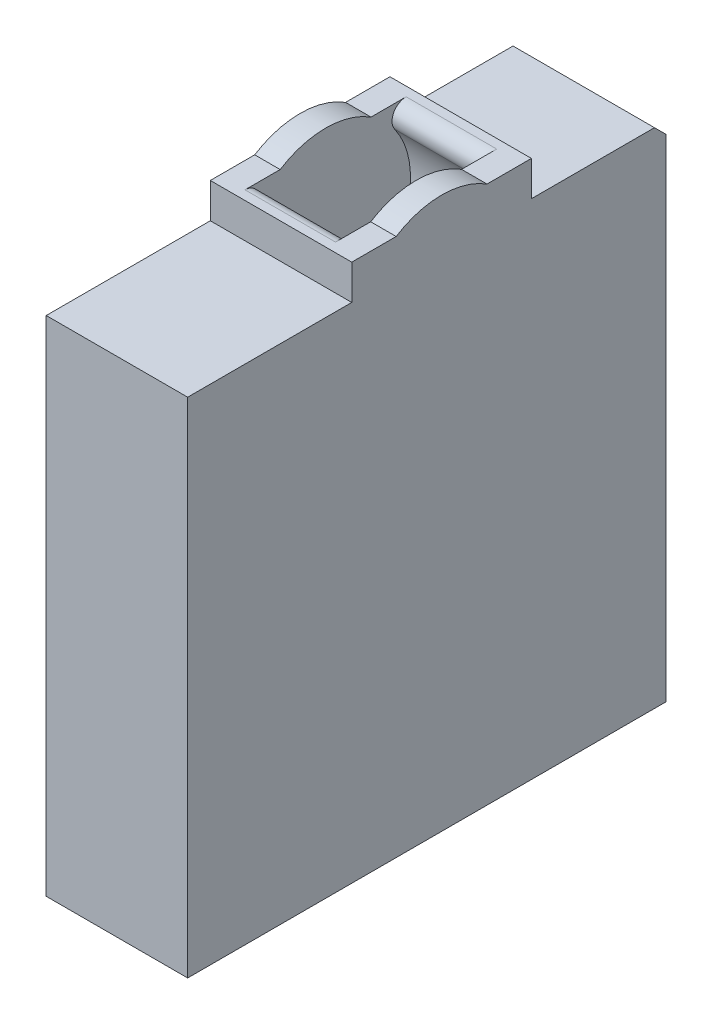
ISO-10303-21;
HEADER;
FILE_DESCRIPTION(('STEP AP214'),'2;1');
FILE_NAME('part.step','',(''),(''),'','','');
FILE_SCHEMA(('AUTOMOTIVE_DESIGN { 1 0 10303 214 1 1 1 1 }'));
ENDSEC;
DATA;
#1=APPLICATION_CONTEXT('core data for automotive mechanical design processes');
#2=APPLICATION_PROTOCOL_DEFINITION('international standard','automotive_design',2000,#1);
#3=PRODUCT_CONTEXT('',#1,'mechanical');
#4=PRODUCT('Part','Part','',(#3));
#5=PRODUCT_RELATED_PRODUCT_CATEGORY('part','',(#4));
#6=PRODUCT_DEFINITION_FORMATION('','',#4);
#7=PRODUCT_DEFINITION_CONTEXT('part definition',#1,'design');
#8=PRODUCT_DEFINITION('design','',#6,#7);
#9=PRODUCT_DEFINITION_SHAPE('','',#8);
#10=(LENGTH_UNIT() NAMED_UNIT(*) SI_UNIT(.MILLI.,.METRE.));
#11=(NAMED_UNIT(*) PLANE_ANGLE_UNIT() SI_UNIT($,.RADIAN.));
#12=(NAMED_UNIT(*) SI_UNIT($,.STERADIAN.) SOLID_ANGLE_UNIT());
#13=UNCERTAINTY_MEASURE_WITH_UNIT(LENGTH_MEASURE(1.E-05),#10,'distance_accuracy_value','');
#14=(GEOMETRIC_REPRESENTATION_CONTEXT(3) GLOBAL_UNCERTAINTY_ASSIGNED_CONTEXT((#13)) GLOBAL_UNIT_ASSIGNED_CONTEXT((#10,
#11,#12)) REPRESENTATION_CONTEXT('',''));
#15=CARTESIAN_POINT('',(0.,0.,0.));
#16=DIRECTION('',(0.,0.,1.));
#17=DIRECTION('',(1.,0.,0.));
#18=AXIS2_PLACEMENT_3D('',#15,#16,#17);
#19=CARTESIAN_POINT('',(-16.2269313180281,-12.67,0.));
#20=DIRECTION('',(1.,0.,0.));
#21=DIRECTION('',(0.,0.,-1.));
#22=AXIS2_PLACEMENT_3D('',#19,#20,#21);
#23=CYLINDRICAL_SURFACE('',#22,15.);
#24=CARTESIAN_POINT('',(4.5,-12.67,0.));
#25=DIRECTION('',(-1.,0.,0.));
#26=DIRECTION('',(0.,0.,1.));
#27=AXIS2_PLACEMENT_3D('',#24,#25,#26);
#28=CIRCLE('',#27,15.);
#29=CARTESIAN_POINT('',(4.5,0.,-8.02938976510669));
#30=VERTEX_POINT('',#29);
#31=CARTESIAN_POINT('',(4.5,0.,8.02938976510669));
#32=VERTEX_POINT('',#31);
#33=EDGE_CURVE('E187',#30,#32,#28,.F.);
#34=ORIENTED_EDGE('',*,*,#33,.F.);
#35=DIRECTION('',(1.,0.,0.));
#36=VECTOR('',#35,1.);
#37=CARTESIAN_POINT('',(-16.2269313180281,0.,-8.02938976510669));
#38=LINE('',#37,#36);
#39=CARTESIAN_POINT('',(0.,0.,-8.02938976510669));
#40=VERTEX_POINT('',#39);
#41=EDGE_CURVE('E184',#40,#30,#38,.T.);
#42=ORIENTED_EDGE('',*,*,#41,.F.);
#43=CARTESIAN_POINT('',(0.,-12.67,0.));
#44=DIRECTION('',(-1.,0.,0.));
#45=DIRECTION('',(0.,0.,1.));
#46=AXIS2_PLACEMENT_3D('',#43,#44,#45);
#47=CIRCLE('',#46,15.);
#48=CARTESIAN_POINT('',(0.,0.,8.02938976510669));
#49=VERTEX_POINT('',#48);
#50=EDGE_CURVE('E186',#40,#49,#47,.F.);
#51=ORIENTED_EDGE('',*,*,#50,.T.);
#52=DIRECTION('',(1.,0.,0.));
#53=VECTOR('',#52,1.);
#54=CARTESIAN_POINT('',(-16.2269313180281,0.,8.02938976510669));
#55=LINE('',#54,#53);
#56=EDGE_CURVE('E191',#49,#32,#55,.T.);
#57=ORIENTED_EDGE('',*,*,#56,.T.);
#58=EDGE_LOOP('',(#34,#42,#51,#57));
#59=FACE_BOUND('',#58,.T.);
#60=ADVANCED_FACE('F43',(#59),#23,.T.);
#61=CARTESIAN_POINT('',(25.,0.,15.875));
#62=DIRECTION('',(0.,-1.,0.));
#63=DIRECTION('',(0.,0.,-1.));
#64=AXIS2_PLACEMENT_3D('',#61,#62,#63);
#65=PLANE('',#64);
#66=DIRECTION('',(1.,0.,0.));
#67=VECTOR('',#66,1.);
#68=CARTESIAN_POINT('',(25.,0.,-14.2415273057352));
#69=LINE('',#68,#67);
#70=CARTESIAN_POINT('',(4.5,0.,-14.2415273057352));
#71=VERTEX_POINT('',#70);
#72=CARTESIAN_POINT('',(20.5,0.,-14.2415273057352));
#73=VERTEX_POINT('',#72);
#74=EDGE_CURVE('E170',#71,#73,#69,.T.);
#75=ORIENTED_EDGE('',*,*,#74,.T.);
#76=DIRECTION('',(0.,0.,1.));
#77=VECTOR('',#76,1.);
#78=CARTESIAN_POINT('',(20.5,0.,15.875));
#79=LINE('',#78,#77);
#80=CARTESIAN_POINT('',(20.5,0.,-8.02938976510669));
#81=VERTEX_POINT('',#80);
#82=EDGE_CURVE('E163',#73,#81,#79,.T.);
#83=ORIENTED_EDGE('',*,*,#82,.T.);
#84=CARTESIAN_POINT('',(25.,0.,-8.02938976510669));
#85=VERTEX_POINT('',#84);
#86=EDGE_CURVE('E167',#81,#85,#38,.T.);
#87=ORIENTED_EDGE('',*,*,#86,.T.);
#88=DIRECTION('',(0.,0.,1.));
#89=VECTOR('',#88,1.);
#90=CARTESIAN_POINT('',(25.,0.,15.875));
#91=LINE('',#90,#89);
#92=CARTESIAN_POINT('',(25.,0.,-15.875));
#93=VERTEX_POINT('',#92);
#94=EDGE_CURVE('E208',#93,#85,#91,.T.);
#95=ORIENTED_EDGE('',*,*,#94,.F.);
#96=DIRECTION('',(-1.,0.,0.));
#97=VECTOR('',#96,1.);
#98=CARTESIAN_POINT('',(25.,0.,-15.875));
#99=LINE('',#98,#97);
#100=CARTESIAN_POINT('',(0.,0.,-15.875));
#101=VERTEX_POINT('',#100);
#102=EDGE_CURVE('E245',#93,#101,#99,.T.);
#103=ORIENTED_EDGE('',*,*,#102,.T.);
#104=DIRECTION('',(0.,0.,1.));
#105=VECTOR('',#104,1.);
#106=CARTESIAN_POINT('',(0.,0.,15.875));
#107=LINE('',#106,#105);
#108=EDGE_CURVE('E227',#101,#40,#107,.T.);
#109=ORIENTED_EDGE('',*,*,#108,.T.);
#110=ORIENTED_EDGE('',*,*,#41,.T.);
#111=DIRECTION('',(0.,0.,-1.));
#112=VECTOR('',#111,1.);
#113=CARTESIAN_POINT('',(4.5,0.,15.875));
#114=LINE('',#113,#112);
#115=EDGE_CURVE('E66',#30,#71,#114,.T.);
#116=ORIENTED_EDGE('',*,*,#115,.T.);
#117=EDGE_LOOP('',(#75,#83,#87,#95,#103,#109,#110,#116));
#118=FACE_BOUND('',#117,.T.);
#119=ADVANCED_FACE('F164',(#118),#65,.F.);
#120=CARTESIAN_POINT('',(25.,-95.07,-39.625));
#121=DIRECTION('',(0.,1.,0.));
#122=DIRECTION('',(0.,0.,1.));
#123=AXIS2_PLACEMENT_3D('',#120,#121,#122);
#124=PLANE('',#123);
#125=DIRECTION('',(0.,0.,-1.));
#126=VECTOR('',#125,1.);
#127=CARTESIAN_POINT('',(0.,-95.07,-39.625));
#128=LINE('',#127,#126);
#129=CARTESIAN_POINT('',(0.,-95.07,44.875));
#130=VERTEX_POINT('',#129);
#131=CARTESIAN_POINT('',(0.,-95.07,-39.625));
#132=VERTEX_POINT('',#131);
#133=EDGE_CURVE('E194',#130,#132,#128,.T.);
#134=ORIENTED_EDGE('',*,*,#133,.T.);
#135=DIRECTION('',(-1.,0.,0.));
#136=VECTOR('',#135,1.);
#137=CARTESIAN_POINT('',(25.,-95.07,-39.625));
#138=LINE('',#137,#136);
#139=CARTESIAN_POINT('',(25.,-95.07,-39.625));
#140=VERTEX_POINT('',#139);
#141=EDGE_CURVE('E251',#140,#132,#138,.T.);
#142=ORIENTED_EDGE('',*,*,#141,.F.);
#143=DIRECTION('',(0.,0.,-1.));
#144=VECTOR('',#143,1.);
#145=CARTESIAN_POINT('',(25.,-95.07,-39.625));
#146=LINE('',#145,#144);
#147=CARTESIAN_POINT('',(25.,-95.07,44.875));
#148=VERTEX_POINT('',#147);
#149=EDGE_CURVE('E196',#148,#140,#146,.T.);
#150=ORIENTED_EDGE('',*,*,#149,.F.);
#151=DIRECTION('',(-1.,0.,0.));
#152=VECTOR('',#151,1.);
#153=CARTESIAN_POINT('',(25.,-95.07,44.875));
#154=LINE('',#153,#152);
#155=EDGE_CURVE('E216',#148,#130,#154,.T.);
#156=ORIENTED_EDGE('',*,*,#155,.T.);
#157=EDGE_LOOP('',(#134,#142,#150,#156));
#158=FACE_BOUND('',#157,.T.);
#159=ADVANCED_FACE('F345',(#158),#124,.F.);
#160=CARTESIAN_POINT('',(25.,-6.17,-39.625));
#161=DIRECTION('',(0.,0.,1.));
#162=DIRECTION('',(0.,-1.,0.));
#163=AXIS2_PLACEMENT_3D('',#160,#161,#162);
#164=PLANE('',#163);
#165=DIRECTION('',(0.,1.,0.));
#166=VECTOR('',#165,1.);
#167=CARTESIAN_POINT('',(0.,-6.17,-39.625));
#168=LINE('',#167,#166);
#169=CARTESIAN_POINT('',(0.,-8.17000000000002,-39.625));
#170=VERTEX_POINT('',#169);
#171=EDGE_CURVE('E219',#132,#170,#168,.T.);
#172=ORIENTED_EDGE('',*,*,#171,.T.);
#173=DIRECTION('',(1.,0.,0.));
#174=VECTOR('',#173,1.);
#175=CARTESIAN_POINT('',(25.,-8.17000000000002,-39.625));
#176=LINE('',#175,#174);
#177=CARTESIAN_POINT('',(25.,-8.17000000000002,-39.625));
#178=VERTEX_POINT('',#177);
#179=EDGE_CURVE('E259',#170,#178,#176,.T.);
#180=ORIENTED_EDGE('',*,*,#179,.T.);
#181=DIRECTION('',(0.,1.,0.));
#182=VECTOR('',#181,1.);
#183=CARTESIAN_POINT('',(25.,-6.17,-39.625));
#184=LINE('',#183,#182);
#185=EDGE_CURVE('E199',#140,#178,#184,.T.);
#186=ORIENTED_EDGE('',*,*,#185,.F.);
#187=ORIENTED_EDGE('',*,*,#141,.T.);
#188=EDGE_LOOP('',(#172,#180,#186,#187));
#189=FACE_BOUND('',#188,.T.);
#190=ADVANCED_FACE('F373',(#189),#164,.F.);
#191=CARTESIAN_POINT('',(25.,-6.17,-15.875));
#192=DIRECTION('',(0.,-1.,0.));
#193=DIRECTION('',(0.,0.,-1.));
#194=AXIS2_PLACEMENT_3D('',#191,#192,#193);
#195=PLANE('',#194);
#196=DIRECTION('',(0.,0.,1.));
#197=VECTOR('',#196,1.);
#198=CARTESIAN_POINT('',(25.,-6.17,-15.875));
#199=LINE('',#198,#197);
#200=CARTESIAN_POINT('',(25.,-6.17,-37.625));
#201=VERTEX_POINT('',#200);
#202=CARTESIAN_POINT('',(25.,-6.17,-15.875));
#203=VERTEX_POINT('',#202);
#204=EDGE_CURVE('E203',#201,#203,#199,.T.);
#205=ORIENTED_EDGE('',*,*,#204,.F.);
#206=DIRECTION('',(-1.,0.,0.));
#207=VECTOR('',#206,1.);
#208=CARTESIAN_POINT('',(25.,-6.17,-37.625));
#209=LINE('',#208,#207);
#210=CARTESIAN_POINT('',(0.,-6.17,-37.625));
#211=VERTEX_POINT('',#210);
#212=EDGE_CURVE('E254',#201,#211,#209,.T.);
#213=ORIENTED_EDGE('',*,*,#212,.T.);
#214=DIRECTION('',(0.,0.,1.));
#215=VECTOR('',#214,1.);
#216=CARTESIAN_POINT('',(0.,-6.17,-15.875));
#217=LINE('',#216,#215);
#218=CARTESIAN_POINT('',(0.,-6.17,-15.875));
#219=VERTEX_POINT('',#218);
#220=EDGE_CURVE('E222',#211,#219,#217,.T.);
#221=ORIENTED_EDGE('',*,*,#220,.T.);
#222=DIRECTION('',(-1.,0.,0.));
#223=VECTOR('',#222,1.);
#224=CARTESIAN_POINT('',(25.,-6.17,-15.875));
#225=LINE('',#224,#223);
#226=EDGE_CURVE('E248',#203,#219,#225,.T.);
#227=ORIENTED_EDGE('',*,*,#226,.F.);
#228=EDGE_LOOP('',(#205,#213,#221,#227));
#229=FACE_BOUND('',#228,.T.);
#230=ADVANCED_FACE('F370',(#229),#195,.F.);
#231=CARTESIAN_POINT('',(25.,0.,-15.875));
#232=DIRECTION('',(0.,0.,1.));
#233=DIRECTION('',(1.,0.,0.));
#234=AXIS2_PLACEMENT_3D('',#231,#232,#233);
#235=PLANE('',#234);
#236=DIRECTION('',(0.,1.,0.));
#237=VECTOR('',#236,1.);
#238=CARTESIAN_POINT('',(0.,0.,-15.875));
#239=LINE('',#238,#237);
#240=EDGE_CURVE('E224',#219,#101,#239,.T.);
#241=ORIENTED_EDGE('',*,*,#240,.T.);
#242=ORIENTED_EDGE('',*,*,#102,.F.);
#243=DIRECTION('',(0.,1.,0.));
#244=VECTOR('',#243,1.);
#245=CARTESIAN_POINT('',(25.,0.,-15.875));
#246=LINE('',#245,#244);
#247=EDGE_CURVE('E205',#203,#93,#246,.T.);
#248=ORIENTED_EDGE('',*,*,#247,.F.);
#249=ORIENTED_EDGE('',*,*,#226,.T.);
#250=EDGE_LOOP('',(#241,#242,#248,#249));
#251=FACE_BOUND('',#250,.T.);
#252=ADVANCED_FACE('F367',(#251),#235,.F.);
#253=CARTESIAN_POINT('',(20.5,0.,8.02938976510669));
#254=VERTEX_POINT('',#253);
#255=CARTESIAN_POINT('',(25.,0.,8.02938976510669));
#256=VERTEX_POINT('',#255);
#257=EDGE_CURVE('E195',#254,#256,#55,.T.);
#258=ORIENTED_EDGE('',*,*,#257,.F.);
#259=DIRECTION('',(0.,0.,1.));
#260=VECTOR('',#259,1.);
#261=CARTESIAN_POINT('',(20.5,0.,15.875));
#262=LINE('',#261,#260);
#263=CARTESIAN_POINT('',(20.5,0.,14.2415273057352));
#264=VERTEX_POINT('',#263);
#265=EDGE_CURVE('E58',#254,#264,#262,.T.);
#266=ORIENTED_EDGE('',*,*,#265,.T.);
#267=DIRECTION('',(1.,0.,0.));
#268=VECTOR('',#267,1.);
#269=CARTESIAN_POINT('',(25.,0.,14.2415273057352));
#270=LINE('',#269,#268);
#271=CARTESIAN_POINT('',(4.5,0.,14.2415273057352));
#272=VERTEX_POINT('',#271);
#273=EDGE_CURVE('E271',#264,#272,#270,.F.);
#274=ORIENTED_EDGE('',*,*,#273,.T.);
#275=DIRECTION('',(0.,0.,-1.));
#276=VECTOR('',#275,1.);
#277=CARTESIAN_POINT('',(4.5,0.,15.875));
#278=LINE('',#277,#276);
#279=EDGE_CURVE('E269',#272,#32,#278,.T.);
#280=ORIENTED_EDGE('',*,*,#279,.T.);
#281=ORIENTED_EDGE('',*,*,#56,.F.);
#282=CARTESIAN_POINT('',(0.,0.,15.875));
#283=VERTEX_POINT('',#282);
#284=EDGE_CURVE('E226',#49,#283,#107,.T.);
#285=ORIENTED_EDGE('',*,*,#284,.T.);
#286=DIRECTION('',(-1.,0.,0.));
#287=VECTOR('',#286,1.);
#288=CARTESIAN_POINT('',(25.,0.,15.875));
#289=LINE('',#288,#287);
#290=CARTESIAN_POINT('',(25.,0.,15.875));
#291=VERTEX_POINT('',#290);
#292=EDGE_CURVE('E242',#291,#283,#289,.T.);
#293=ORIENTED_EDGE('',*,*,#292,.F.);
#294=EDGE_CURVE('E207',#256,#291,#91,.T.);
#295=ORIENTED_EDGE('',*,*,#294,.F.);
#296=EDGE_LOOP('',(#258,#266,#274,#280,#281,#285,#293,#295));
#297=FACE_BOUND('',#296,.T.);
#298=ADVANCED_FACE('F284',(#297),#65,.F.);
#299=CARTESIAN_POINT('',(25.,-6.17,15.875));
#300=DIRECTION('',(0.,0.,-1.));
#301=DIRECTION('',(-1.,0.,0.));
#302=AXIS2_PLACEMENT_3D('',#299,#300,#301);
#303=PLANE('',#302);
#304=DIRECTION('',(0.,-1.,0.));
#305=VECTOR('',#304,1.);
#306=CARTESIAN_POINT('',(0.,-6.17,15.875));
#307=LINE('',#306,#305);
#308=CARTESIAN_POINT('',(0.,-6.17,15.875));
#309=VERTEX_POINT('',#308);
#310=EDGE_CURVE('E229',#283,#309,#307,.T.);
#311=ORIENTED_EDGE('',*,*,#310,.T.);
#312=DIRECTION('',(-1.,0.,0.));
#313=VECTOR('',#312,1.);
#314=CARTESIAN_POINT('',(25.,-6.17,15.875));
#315=LINE('',#314,#313);
#316=CARTESIAN_POINT('',(25.,-6.17,15.875));
#317=VERTEX_POINT('',#316);
#318=EDGE_CURVE('E239',#317,#309,#315,.T.);
#319=ORIENTED_EDGE('',*,*,#318,.F.);
#320=DIRECTION('',(0.,-1.,0.));
#321=VECTOR('',#320,1.);
#322=CARTESIAN_POINT('',(25.,-6.17,15.875));
#323=LINE('',#322,#321);
#324=EDGE_CURVE('E210',#291,#317,#323,.T.);
#325=ORIENTED_EDGE('',*,*,#324,.F.);
#326=ORIENTED_EDGE('',*,*,#292,.T.);
#327=EDGE_LOOP('',(#311,#319,#325,#326));
#328=FACE_BOUND('',#327,.T.);
#329=ADVANCED_FACE('F306',(#328),#303,.F.);
#330=CARTESIAN_POINT('',(25.,-6.17,44.875));
#331=DIRECTION('',(0.,-1.,0.));
#332=DIRECTION('',(0.,0.,-1.));
#333=AXIS2_PLACEMENT_3D('',#330,#331,#332);
#334=PLANE('',#333);
#335=DIRECTION('',(0.,0.,1.));
#336=VECTOR('',#335,1.);
#337=CARTESIAN_POINT('',(0.,-6.17,44.875));
#338=LINE('',#337,#336);
#339=CARTESIAN_POINT('',(0.,-6.17,44.875));
#340=VERTEX_POINT('',#339);
#341=EDGE_CURVE('E231',#309,#340,#338,.T.);
#342=ORIENTED_EDGE('',*,*,#341,.T.);
#343=DIRECTION('',(-1.,0.,0.));
#344=VECTOR('',#343,1.);
#345=CARTESIAN_POINT('',(25.,-6.17,44.875));
#346=LINE('',#345,#344);
#347=CARTESIAN_POINT('',(25.,-6.17,44.875));
#348=VERTEX_POINT('',#347);
#349=EDGE_CURVE('E236',#348,#340,#346,.T.);
#350=ORIENTED_EDGE('',*,*,#349,.F.);
#351=DIRECTION('',(0.,0.,1.));
#352=VECTOR('',#351,1.);
#353=CARTESIAN_POINT('',(25.,-6.17,44.875));
#354=LINE('',#353,#352);
#355=EDGE_CURVE('E212',#317,#348,#354,.T.);
#356=ORIENTED_EDGE('',*,*,#355,.F.);
#357=ORIENTED_EDGE('',*,*,#318,.T.);
#358=EDGE_LOOP('',(#342,#350,#356,#357));
#359=FACE_BOUND('',#358,.T.);
#360=ADVANCED_FACE('F315',(#359),#334,.F.);
#361=CARTESIAN_POINT('',(25.,-95.07,44.875));
#362=DIRECTION('',(0.,0.,-1.));
#363=DIRECTION('',(-1.,0.,0.));
#364=AXIS2_PLACEMENT_3D('',#361,#362,#363);
#365=PLANE('',#364);
#366=DIRECTION('',(0.,-1.,0.));
#367=VECTOR('',#366,1.);
#368=CARTESIAN_POINT('',(0.,-95.07,44.875));
#369=LINE('',#368,#367);
#370=EDGE_CURVE('E200',#340,#130,#369,.T.);
#371=ORIENTED_EDGE('',*,*,#370,.T.);
#372=ORIENTED_EDGE('',*,*,#155,.F.);
#373=DIRECTION('',(0.,-1.,0.));
#374=VECTOR('',#373,1.);
#375=CARTESIAN_POINT('',(25.,-95.07,44.875));
#376=LINE('',#375,#374);
#377=EDGE_CURVE('E214',#348,#148,#376,.T.);
#378=ORIENTED_EDGE('',*,*,#377,.F.);
#379=ORIENTED_EDGE('',*,*,#349,.T.);
#380=EDGE_LOOP('',(#371,#372,#378,#379));
#381=FACE_BOUND('',#380,.T.);
#382=ADVANCED_FACE('F319',(#381),#365,.F.);
#383=CARTESIAN_POINT('',(25.,0.,0.));
#384=DIRECTION('',(-1.,0.,0.));
#385=DIRECTION('',(0.,0.,1.));
#386=AXIS2_PLACEMENT_3D('',#383,#384,#385);
#387=PLANE('',#386);
#388=ORIENTED_EDGE('',*,*,#185,.T.);
#389=DIRECTION('',(0.,-0.707106781186548,-0.707106781186548));
#390=VECTOR('',#389,1.);
#391=CARTESIAN_POINT('',(25.,-6.17,-37.625));
#392=LINE('',#391,#390);
#393=EDGE_CURVE('E261',#178,#201,#392,.F.);
#394=ORIENTED_EDGE('',*,*,#393,.T.);
#395=ORIENTED_EDGE('',*,*,#204,.T.);
#396=ORIENTED_EDGE('',*,*,#247,.T.);
#397=ORIENTED_EDGE('',*,*,#94,.T.);
#398=CARTESIAN_POINT('',(25.,-12.67,0.));
#399=DIRECTION('',(1.,0.,0.));
#400=DIRECTION('',(0.,0.,-1.));
#401=AXIS2_PLACEMENT_3D('',#398,#399,#400);
#402=CIRCLE('',#401,15.);
#403=EDGE_CURVE('E183',#85,#256,#402,.T.);
#404=ORIENTED_EDGE('',*,*,#403,.T.);
#405=ORIENTED_EDGE('',*,*,#294,.T.);
#406=ORIENTED_EDGE('',*,*,#324,.T.);
#407=ORIENTED_EDGE('',*,*,#355,.T.);
#408=ORIENTED_EDGE('',*,*,#377,.T.);
#409=ORIENTED_EDGE('',*,*,#149,.T.);
#410=EDGE_LOOP('',(#388,#394,#395,#396,#397,#404,#405,#406,#407,#408,#409));
#411=FACE_BOUND('',#410,.T.);
#412=ADVANCED_FACE('F323',(#411),#387,.F.);
#413=CARTESIAN_POINT('',(0.,0.,0.));
#414=DIRECTION('',(-1.,0.,0.));
#415=DIRECTION('',(0.,0.,1.));
#416=AXIS2_PLACEMENT_3D('',#413,#414,#415);
#417=PLANE('',#416);
#418=ORIENTED_EDGE('',*,*,#220,.F.);
#419=DIRECTION('',(0.,0.707106781186548,0.707106781186548));
#420=VECTOR('',#419,1.);
#421=CARTESIAN_POINT('',(0.,15.7275,-15.7275));
#422=LINE('',#421,#420);
#423=EDGE_CURVE('E257',#211,#170,#422,.F.);
#424=ORIENTED_EDGE('',*,*,#423,.T.);
#425=ORIENTED_EDGE('',*,*,#171,.F.);
#426=ORIENTED_EDGE('',*,*,#133,.F.);
#427=ORIENTED_EDGE('',*,*,#370,.F.);
#428=ORIENTED_EDGE('',*,*,#341,.F.);
#429=ORIENTED_EDGE('',*,*,#310,.F.);
#430=ORIENTED_EDGE('',*,*,#284,.F.);
#431=ORIENTED_EDGE('',*,*,#50,.F.);
#432=ORIENTED_EDGE('',*,*,#108,.F.);
#433=ORIENTED_EDGE('',*,*,#240,.F.);
#434=EDGE_LOOP('',(#418,#424,#425,#426,#427,#428,#429,#430,#431,#432,#433));
#435=FACE_BOUND('',#434,.T.);
#436=ADVANCED_FACE('F310',(#435),#417,.T.);
#437=CARTESIAN_POINT('',(20.5,-12.67,0.));
#438=DIRECTION('',(1.,0.,0.));
#439=DIRECTION('',(0.,0.,-1.));
#440=AXIS2_PLACEMENT_3D('',#437,#438,#439);
#441=CIRCLE('',#440,15.);
#442=EDGE_CURVE('E174',#81,#254,#441,.T.);
#443=ORIENTED_EDGE('',*,*,#442,.T.);
#444=ORIENTED_EDGE('',*,*,#257,.T.);
#445=ORIENTED_EDGE('',*,*,#403,.F.);
#446=ORIENTED_EDGE('',*,*,#86,.F.);
#447=EDGE_LOOP('',(#443,#444,#445,#446));
#448=FACE_BOUND('',#447,.T.);
#449=ADVANCED_FACE('F181',(#448),#23,.T.);
#450=CARTESIAN_POINT('',(-42.4264068711929,-12.67,0.));
#451=DIRECTION('',(1.,0.,0.));
#452=DIRECTION('',(0.,0.,-1.));
#453=AXIS2_PLACEMENT_3D('',#450,#451,#452);
#454=CYLINDRICAL_SURFACE('',#453,15.);
#455=CARTESIAN_POINT('',(20.5,-3.95285714285714,12.2070234049158));
#456=VERTEX_POINT('',#455);
#457=CARTESIAN_POINT('',(20.5,-3.95285714285714,-12.2070234049158));
#458=VERTEX_POINT('',#457);
#459=EDGE_CURVE('E178',#456,#458,#441,.T.);
#460=ORIENTED_EDGE('',*,*,#459,.T.);
#461=DIRECTION('',(1.,0.,0.));
#462=VECTOR('',#461,1.);
#463=CARTESIAN_POINT('',(-42.4264068711929,-3.95285714285714,-12.2070234049158));
#464=LINE('',#463,#462);
#465=CARTESIAN_POINT('',(4.5,-3.95285714285714,-12.2070234049158));
#466=VERTEX_POINT('',#465);
#467=EDGE_CURVE('E267',#458,#466,#464,.F.);
#468=ORIENTED_EDGE('',*,*,#467,.T.);
#469=CARTESIAN_POINT('',(4.5,-3.95285714285714,12.2070234049158));
#470=VERTEX_POINT('',#469);
#471=EDGE_CURVE('E177',#470,#466,#28,.F.);
#472=ORIENTED_EDGE('',*,*,#471,.F.);
#473=DIRECTION('',(1.,0.,0.));
#474=VECTOR('',#473,1.);
#475=CARTESIAN_POINT('',(-42.4264068711929,-3.95285714285714,12.2070234049158));
#476=LINE('',#475,#474);
#477=EDGE_CURVE('E171',#470,#456,#476,.T.);
#478=ORIENTED_EDGE('',*,*,#477,.T.);
#479=EDGE_LOOP('',(#460,#468,#472,#478));
#480=FACE_BOUND('',#479,.T.);
#481=ADVANCED_FACE('F292',(#480),#454,.F.);
#482=CARTESIAN_POINT('',(4.5,0.,0.));
#483=DIRECTION('',(-1.,0.,0.));
#484=DIRECTION('',(0.,0.,1.));
#485=AXIS2_PLACEMENT_3D('',#482,#483,#484);
#486=PLANE('',#485);
#487=ORIENTED_EDGE('',*,*,#33,.T.);
#488=ORIENTED_EDGE('',*,*,#279,.F.);
#489=CARTESIAN_POINT('',(4.5,-2.5,14.2415273057352));
#490=DIRECTION('',(-1.,0.,0.));
#491=DIRECTION('',(0.,0.,1.));
#492=AXIS2_PLACEMENT_3D('',#489,#490,#491);
#493=CIRCLE('',#492,2.5);
#494=EDGE_CURVE('E12',#272,#470,#493,.T.);
#495=ORIENTED_EDGE('',*,*,#494,.T.);
#496=ORIENTED_EDGE('',*,*,#471,.T.);
#497=CARTESIAN_POINT('',(4.5,-2.5,-14.2415273057352));
#498=DIRECTION('',(-1.,0.,0.));
#499=DIRECTION('',(0.,0.,1.));
#500=AXIS2_PLACEMENT_3D('',#497,#498,#499);
#501=CIRCLE('',#500,2.5);
#502=EDGE_CURVE('E277',#466,#71,#501,.T.);
#503=ORIENTED_EDGE('',*,*,#502,.T.);
#504=ORIENTED_EDGE('',*,*,#115,.F.);
#505=EDGE_LOOP('',(#487,#488,#495,#496,#503,#504));
#506=FACE_BOUND('',#505,.T.);
#507=ADVANCED_FACE('F289',(#506),#486,.F.);
#508=CARTESIAN_POINT('',(20.5,-12.67,0.));
#509=DIRECTION('',(1.,0.,0.));
#510=DIRECTION('',(0.,0.,-1.));
#511=AXIS2_PLACEMENT_3D('',#508,#509,#510);
#512=PLANE('',#511);
#513=ORIENTED_EDGE('',*,*,#442,.F.);
#514=ORIENTED_EDGE('',*,*,#82,.F.);
#515=CARTESIAN_POINT('',(20.5,-2.5,-14.2415273057352));
#516=DIRECTION('',(1.,0.,0.));
#517=DIRECTION('',(0.,0.,-1.));
#518=AXIS2_PLACEMENT_3D('',#515,#516,#517);
#519=CIRCLE('',#518,2.5);
#520=EDGE_CURVE('E275',#73,#458,#519,.T.);
#521=ORIENTED_EDGE('',*,*,#520,.T.);
#522=ORIENTED_EDGE('',*,*,#459,.F.);
#523=CARTESIAN_POINT('',(20.5,-2.5,14.2415273057352));
#524=DIRECTION('',(1.,0.,0.));
#525=DIRECTION('',(0.,0.,-1.));
#526=AXIS2_PLACEMENT_3D('',#523,#524,#525);
#527=CIRCLE('',#526,2.5);
#528=EDGE_CURVE('E51',#456,#264,#527,.T.);
#529=ORIENTED_EDGE('',*,*,#528,.T.);
#530=ORIENTED_EDGE('',*,*,#265,.F.);
#531=EDGE_LOOP('',(#513,#514,#521,#522,#529,#530));
#532=FACE_BOUND('',#531,.T.);
#533=ADVANCED_FACE('F175',(#532),#512,.F.);
#534=CARTESIAN_POINT('',(25.,-6.17,-37.625));
#535=DIRECTION('',(0.,-0.707106781186547,0.707106781186547));
#536=DIRECTION('',(-1.,0.,0.));
#537=AXIS2_PLACEMENT_3D('',#534,#535,#536);
#538=PLANE('',#537);
#539=ORIENTED_EDGE('',*,*,#393,.F.);
#540=ORIENTED_EDGE('',*,*,#179,.F.);
#541=ORIENTED_EDGE('',*,*,#423,.F.);
#542=ORIENTED_EDGE('',*,*,#212,.F.);
#543=EDGE_LOOP('',(#539,#540,#541,#542));
#544=FACE_BOUND('',#543,.T.);
#545=ADVANCED_FACE('F333',(#544),#538,.F.);
#546=CARTESIAN_POINT('',(-42.4264068711929,-2.5,-14.2415273057352));
#547=DIRECTION('',(1.,0.,0.));
#548=DIRECTION('',(0.,0.,-1.));
#549=AXIS2_PLACEMENT_3D('',#546,#547,#548);
#550=CYLINDRICAL_SURFACE('',#549,2.5);
#551=ORIENTED_EDGE('',*,*,#502,.F.);
#552=ORIENTED_EDGE('',*,*,#467,.F.);
#553=ORIENTED_EDGE('',*,*,#520,.F.);
#554=ORIENTED_EDGE('',*,*,#74,.F.);
#555=EDGE_LOOP('',(#551,#552,#553,#554));
#556=FACE_BOUND('',#555,.T.);
#557=ADVANCED_FACE('F331',(#556),#550,.T.);
#558=CARTESIAN_POINT('',(-42.4264068711929,-2.5,14.2415273057352));
#559=DIRECTION('',(1.,0.,0.));
#560=DIRECTION('',(0.,0.,-1.));
#561=AXIS2_PLACEMENT_3D('',#558,#559,#560);
#562=CYLINDRICAL_SURFACE('',#561,2.5);
#563=ORIENTED_EDGE('',*,*,#494,.F.);
#564=ORIENTED_EDGE('',*,*,#273,.F.);
#565=ORIENTED_EDGE('',*,*,#528,.F.);
#566=ORIENTED_EDGE('',*,*,#477,.F.);
#567=EDGE_LOOP('',(#563,#564,#565,#566));
#568=FACE_BOUND('',#567,.T.);
#569=ADVANCED_FACE('F45',(#568),#562,.T.);
#570=CLOSED_SHELL('',(#60,#119,#159,#190,#230,#252,#298,#329,#360,#382,#412,#436,#449,#481,#507,
#533,#545,#557,#569));
#571=MANIFOLD_SOLID_BREP('B2',#570);
#572=ADVANCED_BREP_SHAPE_REPRESENTATION('',(#18,#571),#14);
#573=SHAPE_DEFINITION_REPRESENTATION(#9,#572);
ENDSEC;
END-ISO-10303-21;
